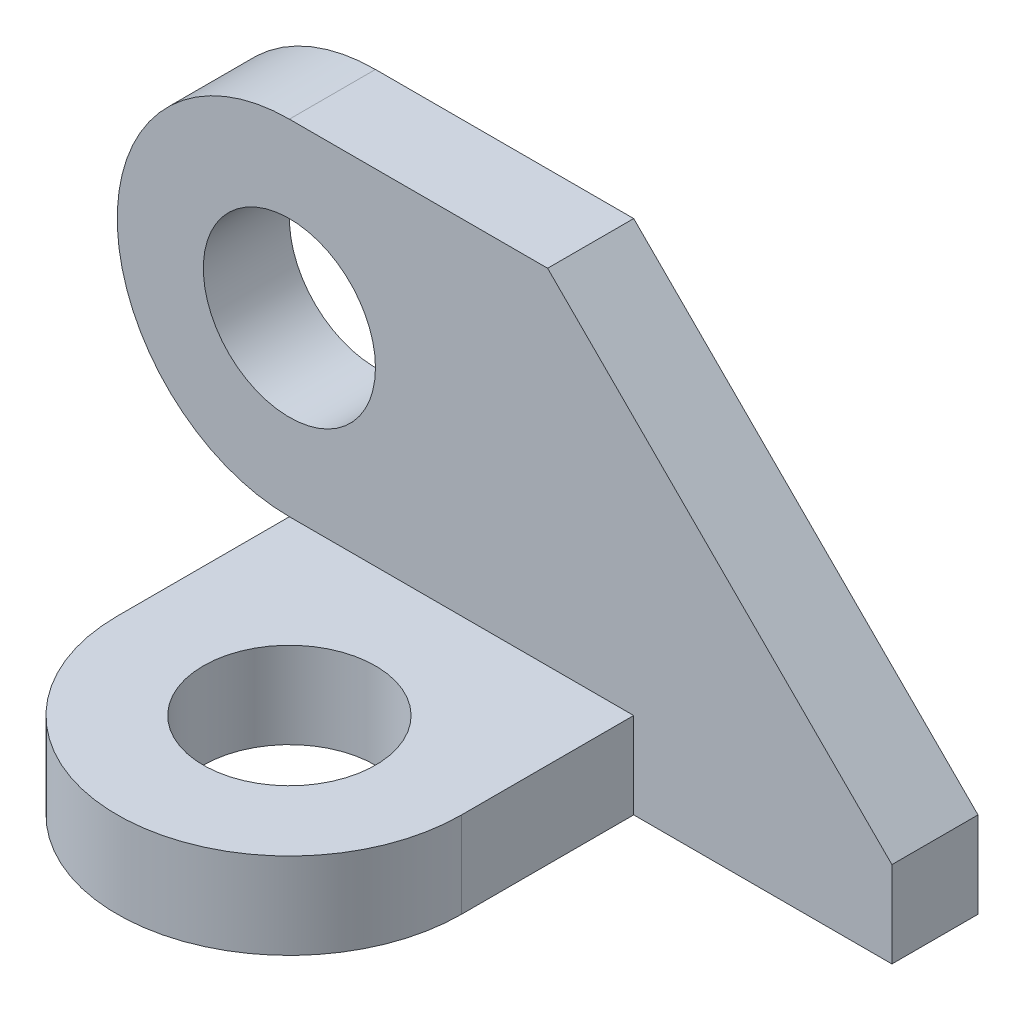
ISO-10303-21;
HEADER;
FILE_DESCRIPTION(('STEP AP214'),'2;1');
FILE_NAME('part.step','',(''),(''),'','','');
FILE_SCHEMA(('AUTOMOTIVE_DESIGN { 1 0 10303 214 1 1 1 1 }'));
ENDSEC;
DATA;
#1=APPLICATION_CONTEXT('core data for automotive mechanical design processes');
#2=APPLICATION_PROTOCOL_DEFINITION('international standard','automotive_design',2000,#1);
#3=PRODUCT_CONTEXT('',#1,'mechanical');
#4=PRODUCT('Part','Part','',(#3));
#5=PRODUCT_RELATED_PRODUCT_CATEGORY('part','',(#4));
#6=PRODUCT_DEFINITION_FORMATION('','',#4);
#7=PRODUCT_DEFINITION_CONTEXT('part definition',#1,'design');
#8=PRODUCT_DEFINITION('design','',#6,#7);
#9=PRODUCT_DEFINITION_SHAPE('','',#8);
#10=(LENGTH_UNIT() NAMED_UNIT(*) SI_UNIT(.MILLI.,.METRE.));
#11=(NAMED_UNIT(*) PLANE_ANGLE_UNIT() SI_UNIT($,.RADIAN.));
#12=(NAMED_UNIT(*) SI_UNIT($,.STERADIAN.) SOLID_ANGLE_UNIT());
#13=UNCERTAINTY_MEASURE_WITH_UNIT(LENGTH_MEASURE(1.E-05),#10,'distance_accuracy_value','');
#14=(GEOMETRIC_REPRESENTATION_CONTEXT(3) GLOBAL_UNCERTAINTY_ASSIGNED_CONTEXT((#13)) GLOBAL_UNIT_ASSIGNED_CONTEXT((#10,
#11,#12)) REPRESENTATION_CONTEXT('',''));
#15=CARTESIAN_POINT('',(0.,0.,0.));
#16=DIRECTION('',(0.,0.,1.));
#17=DIRECTION('',(1.,0.,0.));
#18=AXIS2_PLACEMENT_3D('',#15,#16,#17);
#19=CARTESIAN_POINT('',(0.,0.,5.));
#20=DIRECTION('',(0.,0.,1.));
#21=DIRECTION('',(1.,0.,0.));
#22=AXIS2_PLACEMENT_3D('',#19,#20,#21);
#23=PLANE('',#22);
#24=DIRECTION('',(-1.,0.,0.));
#25=VECTOR('',#24,1.);
#26=CARTESIAN_POINT('',(35.,-10.,5.));
#27=LINE('',#26,#25);
#28=CARTESIAN_POINT('',(20.,-10.,5.));
#29=VERTEX_POINT('',#28);
#30=CARTESIAN_POINT('',(0.,-10.,5.));
#31=VERTEX_POINT('',#30);
#32=EDGE_CURVE('E117',#29,#31,#27,.T.);
#33=ORIENTED_EDGE('',*,*,#32,.F.);
#34=DIRECTION('',(0.,-1.,0.));
#35=VECTOR('',#34,1.);
#36=CARTESIAN_POINT('',(20.,-10.,5.));
#37=LINE('',#36,#35);
#38=CARTESIAN_POINT('',(20.,-15.,5.));
#39=VERTEX_POINT('',#38);
#40=EDGE_CURVE('E114',#29,#39,#37,.T.);
#41=ORIENTED_EDGE('',*,*,#40,.T.);
#42=DIRECTION('',(1.,0.,0.));
#43=VECTOR('',#42,1.);
#44=CARTESIAN_POINT('',(35.,-15.,5.));
#45=LINE('',#44,#43);
#46=CARTESIAN_POINT('',(35.,-15.,5.));
#47=VERTEX_POINT('',#46);
#48=EDGE_CURVE('E90',#39,#47,#45,.T.);
#49=ORIENTED_EDGE('',*,*,#48,.T.);
#50=DIRECTION('',(0.,1.,0.));
#51=VECTOR('',#50,1.);
#52=CARTESIAN_POINT('',(35.,-10.,5.));
#53=LINE('',#52,#51);
#54=CARTESIAN_POINT('',(35.,-10.,5.));
#55=VERTEX_POINT('',#54);
#56=EDGE_CURVE('E147',#47,#55,#53,.T.);
#57=ORIENTED_EDGE('',*,*,#56,.T.);
#58=DIRECTION('',(-0.707106781186548,0.707106781186547,0.));
#59=VECTOR('',#58,1.);
#60=CARTESIAN_POINT('',(15.,10.,5.));
#61=LINE('',#60,#59);
#62=CARTESIAN_POINT('',(15.,10.,5.));
#63=VERTEX_POINT('',#62);
#64=EDGE_CURVE('E149',#55,#63,#61,.T.);
#65=ORIENTED_EDGE('',*,*,#64,.T.);
#66=DIRECTION('',(-1.,0.,0.));
#67=VECTOR('',#66,1.);
#68=CARTESIAN_POINT('',(0.,10.,5.));
#69=LINE('',#68,#67);
#70=CARTESIAN_POINT('',(0.,10.,5.));
#71=VERTEX_POINT('',#70);
#72=EDGE_CURVE('E57',#63,#71,#69,.T.);
#73=ORIENTED_EDGE('',*,*,#72,.T.);
#74=CARTESIAN_POINT('',(0.,0.,5.));
#75=DIRECTION('',(0.,0.,1.));
#76=DIRECTION('',(1.,0.,0.));
#77=AXIS2_PLACEMENT_3D('',#74,#75,#76);
#78=CIRCLE('',#77,10.);
#79=EDGE_CURVE('E144',#71,#31,#78,.T.);
#80=ORIENTED_EDGE('',*,*,#79,.T.);
#81=EDGE_LOOP('',(#33,#41,#49,#57,#65,#73,#80));
#82=FACE_BOUND('',#81,.T.);
#83=CARTESIAN_POINT('',(0.,0.,5.));
#84=DIRECTION('',(0.,0.,1.));
#85=DIRECTION('',(1.,0.,0.));
#86=AXIS2_PLACEMENT_3D('',#83,#84,#85);
#87=CIRCLE('',#86,5.);
#88=CARTESIAN_POINT('',(5.,0.,5.));
#89=VERTEX_POINT('',#88);
#90=EDGE_CURVE('E135',#89,#89,#87,.T.);
#91=ORIENTED_EDGE('',*,*,#90,.F.);
#92=EDGE_LOOP('',(#91));
#93=FACE_BOUND('',#92,.T.);
#94=ADVANCED_FACE('F33',(#82,#93),#23,.T.);
#95=CARTESIAN_POINT('',(0.,0.,0.));
#96=DIRECTION('',(0.,0.,1.));
#97=DIRECTION('',(1.,0.,0.));
#98=AXIS2_PLACEMENT_3D('',#95,#96,#97);
#99=PLANE('',#98);
#100=CARTESIAN_POINT('',(0.,0.,0.));
#101=DIRECTION('',(0.,0.,1.));
#102=DIRECTION('',(1.,0.,0.));
#103=AXIS2_PLACEMENT_3D('',#100,#101,#102);
#104=CIRCLE('',#103,10.);
#105=CARTESIAN_POINT('',(0.,10.,0.));
#106=VERTEX_POINT('',#105);
#107=CARTESIAN_POINT('',(0.,-10.,0.));
#108=VERTEX_POINT('',#107);
#109=EDGE_CURVE('E142',#106,#108,#104,.T.);
#110=ORIENTED_EDGE('',*,*,#109,.F.);
#111=DIRECTION('',(-1.,0.,0.));
#112=VECTOR('',#111,1.);
#113=CARTESIAN_POINT('',(0.,10.,0.));
#114=LINE('',#113,#112);
#115=CARTESIAN_POINT('',(15.,10.,0.));
#116=VERTEX_POINT('',#115);
#117=EDGE_CURVE('E84',#116,#106,#114,.T.);
#118=ORIENTED_EDGE('',*,*,#117,.F.);
#119=DIRECTION('',(-0.707106781186548,0.707106781186547,0.));
#120=VECTOR('',#119,1.);
#121=CARTESIAN_POINT('',(15.,10.,0.));
#122=LINE('',#121,#120);
#123=CARTESIAN_POINT('',(35.,-10.,0.));
#124=VERTEX_POINT('',#123);
#125=EDGE_CURVE('E161',#124,#116,#122,.T.);
#126=ORIENTED_EDGE('',*,*,#125,.F.);
#127=DIRECTION('',(0.,1.,0.));
#128=VECTOR('',#127,1.);
#129=CARTESIAN_POINT('',(35.,-10.,0.));
#130=LINE('',#129,#128);
#131=CARTESIAN_POINT('',(35.,-15.,0.));
#132=VERTEX_POINT('',#131);
#133=EDGE_CURVE('E159',#132,#124,#130,.T.);
#134=ORIENTED_EDGE('',*,*,#133,.F.);
#135=DIRECTION('',(1.,0.,0.));
#136=VECTOR('',#135,1.);
#137=CARTESIAN_POINT('',(35.,-15.,0.));
#138=LINE('',#137,#136);
#139=CARTESIAN_POINT('',(0.,-15.,0.));
#140=VERTEX_POINT('',#139);
#141=EDGE_CURVE('E157',#140,#132,#138,.T.);
#142=ORIENTED_EDGE('',*,*,#141,.F.);
#143=DIRECTION('',(0.,-1.,0.));
#144=VECTOR('',#143,1.);
#145=CARTESIAN_POINT('',(0.,-15.,0.));
#146=LINE('',#145,#144);
#147=EDGE_CURVE('E155',#108,#140,#146,.T.);
#148=ORIENTED_EDGE('',*,*,#147,.F.);
#149=EDGE_LOOP('',(#110,#118,#126,#134,#142,#148));
#150=FACE_BOUND('',#149,.T.);
#151=CARTESIAN_POINT('',(0.,0.,0.));
#152=DIRECTION('',(0.,0.,1.));
#153=DIRECTION('',(1.,0.,0.));
#154=AXIS2_PLACEMENT_3D('',#151,#152,#153);
#155=CIRCLE('',#154,5.);
#156=CARTESIAN_POINT('',(5.,0.,0.));
#157=VERTEX_POINT('',#156);
#158=EDGE_CURVE('E132',#157,#157,#155,.T.);
#159=ORIENTED_EDGE('',*,*,#158,.T.);
#160=EDGE_LOOP('',(#159));
#161=FACE_BOUND('',#160,.T.);
#162=ADVANCED_FACE('F181',(#150,#161),#99,.F.);
#163=CARTESIAN_POINT('',(0.,0.,5.));
#164=DIRECTION('',(0.,0.,-1.));
#165=DIRECTION('',(-1.,0.,0.));
#166=AXIS2_PLACEMENT_3D('',#163,#164,#165);
#167=CYLINDRICAL_SURFACE('',#166,10.);
#168=ORIENTED_EDGE('',*,*,#109,.T.);
#169=DIRECTION('',(0.,0.,-1.));
#170=VECTOR('',#169,1.);
#171=CARTESIAN_POINT('',(0.,-10.,5.));
#172=LINE('',#171,#170);
#173=EDGE_CURVE('E11',#31,#108,#172,.T.);
#174=ORIENTED_EDGE('',*,*,#173,.F.);
#175=ORIENTED_EDGE('',*,*,#79,.F.);
#176=DIRECTION('',(0.,0.,-1.));
#177=VECTOR('',#176,1.);
#178=CARTESIAN_POINT('',(0.,10.,5.));
#179=LINE('',#178,#177);
#180=EDGE_CURVE('E152',#71,#106,#179,.T.);
#181=ORIENTED_EDGE('',*,*,#180,.T.);
#182=EDGE_LOOP('',(#168,#174,#175,#181));
#183=FACE_BOUND('',#182,.T.);
#184=ADVANCED_FACE('F35',(#183),#167,.T.);
#185=CARTESIAN_POINT('',(0.,-15.,5.));
#186=DIRECTION('',(1.,0.,0.));
#187=DIRECTION('',(0.,0.,-1.));
#188=AXIS2_PLACEMENT_3D('',#185,#186,#187);
#189=PLANE('',#188);
#190=ORIENTED_EDGE('',*,*,#147,.T.);
#191=DIRECTION('',(0.,0.,-1.));
#192=VECTOR('',#191,1.);
#193=CARTESIAN_POINT('',(0.,-15.,5.));
#194=LINE('',#193,#192);
#195=CARTESIAN_POINT('',(0.,-15.,15.));
#196=VERTEX_POINT('',#195);
#197=EDGE_CURVE('E41',#196,#140,#194,.T.);
#198=ORIENTED_EDGE('',*,*,#197,.F.);
#199=DIRECTION('',(0.,-1.,0.));
#200=VECTOR('',#199,1.);
#201=CARTESIAN_POINT('',(0.,-10.,15.));
#202=LINE('',#201,#200);
#203=CARTESIAN_POINT('',(0.,-10.,15.));
#204=VERTEX_POINT('',#203);
#205=EDGE_CURVE('E137',#204,#196,#202,.T.);
#206=ORIENTED_EDGE('',*,*,#205,.F.);
#207=DIRECTION('',(0.,0.,1.));
#208=VECTOR('',#207,1.);
#209=CARTESIAN_POINT('',(0.,-10.,5.00000000000001));
#210=LINE('',#209,#208);
#211=EDGE_CURVE('E124',#31,#204,#210,.T.);
#212=ORIENTED_EDGE('',*,*,#211,.F.);
#213=ORIENTED_EDGE('',*,*,#173,.T.);
#214=EDGE_LOOP('',(#190,#198,#206,#212,#213));
#215=FACE_BOUND('',#214,.T.);
#216=ADVANCED_FACE('F208',(#215),#189,.F.);
#217=CARTESIAN_POINT('',(35.,-15.,5.));
#218=DIRECTION('',(0.,1.,0.));
#219=DIRECTION('',(-1.,0.,0.));
#220=AXIS2_PLACEMENT_3D('',#217,#218,#219);
#221=PLANE('',#220);
#222=ORIENTED_EDGE('',*,*,#141,.T.);
#223=DIRECTION('',(0.,0.,-1.));
#224=VECTOR('',#223,1.);
#225=CARTESIAN_POINT('',(35.,-15.,5.));
#226=LINE('',#225,#224);
#227=EDGE_CURVE('E170',#47,#132,#226,.T.);
#228=ORIENTED_EDGE('',*,*,#227,.F.);
#229=ORIENTED_EDGE('',*,*,#48,.F.);
#230=DIRECTION('',(0.,0.,-1.));
#231=VECTOR('',#230,1.);
#232=CARTESIAN_POINT('',(20.,-15.,5.));
#233=LINE('',#232,#231);
#234=CARTESIAN_POINT('',(20.,-15.,15.));
#235=VERTEX_POINT('',#234);
#236=EDGE_CURVE('E48',#235,#39,#233,.T.);
#237=ORIENTED_EDGE('',*,*,#236,.F.);
#238=CARTESIAN_POINT('',(10.,-15.,15.));
#239=DIRECTION('',(0.,1.,0.));
#240=DIRECTION('',(-1.,0.,0.));
#241=AXIS2_PLACEMENT_3D('',#238,#239,#240);
#242=CIRCLE('',#241,10.);
#243=EDGE_CURVE('E131',#196,#235,#242,.T.);
#244=ORIENTED_EDGE('',*,*,#243,.F.);
#245=ORIENTED_EDGE('',*,*,#197,.T.);
#246=EDGE_LOOP('',(#222,#228,#229,#237,#244,#245));
#247=FACE_BOUND('',#246,.T.);
#248=CARTESIAN_POINT('',(10.,-15.,15.));
#249=DIRECTION('',(0.,1.,0.));
#250=DIRECTION('',(-1.,0.,0.));
#251=AXIS2_PLACEMENT_3D('',#248,#249,#250);
#252=CIRCLE('',#251,5.);
#253=CARTESIAN_POINT('',(5.,-15.,15.));
#254=VERTEX_POINT('',#253);
#255=EDGE_CURVE('E229',#254,#254,#252,.T.);
#256=ORIENTED_EDGE('',*,*,#255,.T.);
#257=EDGE_LOOP('',(#256));
#258=FACE_BOUND('',#257,.T.);
#259=ADVANCED_FACE('F175',(#247,#258),#221,.F.);
#260=CARTESIAN_POINT('',(35.,-10.,5.));
#261=DIRECTION('',(-1.,0.,0.));
#262=DIRECTION('',(0.,0.,1.));
#263=AXIS2_PLACEMENT_3D('',#260,#261,#262);
#264=PLANE('',#263);
#265=ORIENTED_EDGE('',*,*,#133,.T.);
#266=DIRECTION('',(0.,0.,-1.));
#267=VECTOR('',#266,1.);
#268=CARTESIAN_POINT('',(35.,-10.,5.));
#269=LINE('',#268,#267);
#270=EDGE_CURVE('E167',#55,#124,#269,.T.);
#271=ORIENTED_EDGE('',*,*,#270,.F.);
#272=ORIENTED_EDGE('',*,*,#56,.F.);
#273=ORIENTED_EDGE('',*,*,#227,.T.);
#274=EDGE_LOOP('',(#265,#271,#272,#273));
#275=FACE_BOUND('',#274,.T.);
#276=ADVANCED_FACE('F186',(#275),#264,.F.);
#277=CARTESIAN_POINT('',(15.,10.,5.));
#278=DIRECTION('',(-0.707106781186547,-0.707106781186548,0.));
#279=DIRECTION('',(0.707106781186548,-0.707106781186547,0.));
#280=AXIS2_PLACEMENT_3D('',#277,#278,#279);
#281=PLANE('',#280);
#282=ORIENTED_EDGE('',*,*,#125,.T.);
#283=DIRECTION('',(0.,0.,-1.));
#284=VECTOR('',#283,1.);
#285=CARTESIAN_POINT('',(15.,10.,5.));
#286=LINE('',#285,#284);
#287=EDGE_CURVE('E165',#63,#116,#286,.T.);
#288=ORIENTED_EDGE('',*,*,#287,.F.);
#289=ORIENTED_EDGE('',*,*,#64,.F.);
#290=ORIENTED_EDGE('',*,*,#270,.T.);
#291=EDGE_LOOP('',(#282,#288,#289,#290));
#292=FACE_BOUND('',#291,.T.);
#293=ADVANCED_FACE('F190',(#292),#281,.F.);
#294=CARTESIAN_POINT('',(0.,10.,5.));
#295=DIRECTION('',(0.,-1.,0.));
#296=DIRECTION('',(1.,0.,0.));
#297=AXIS2_PLACEMENT_3D('',#294,#295,#296);
#298=PLANE('',#297);
#299=ORIENTED_EDGE('',*,*,#117,.T.);
#300=ORIENTED_EDGE('',*,*,#180,.F.);
#301=ORIENTED_EDGE('',*,*,#72,.F.);
#302=ORIENTED_EDGE('',*,*,#287,.T.);
#303=EDGE_LOOP('',(#299,#300,#301,#302));
#304=FACE_BOUND('',#303,.T.);
#305=ADVANCED_FACE('F200',(#304),#298,.F.);
#306=CARTESIAN_POINT('',(0.,0.,5.));
#307=DIRECTION('',(0.,0.,-1.));
#308=DIRECTION('',(-1.,0.,0.));
#309=AXIS2_PLACEMENT_3D('',#306,#307,#308);
#310=CYLINDRICAL_SURFACE('',#309,5.);
#311=ORIENTED_EDGE('',*,*,#90,.T.);
#312=EDGE_LOOP('',(#311));
#313=FACE_BOUND('',#312,.T.);
#314=ORIENTED_EDGE('',*,*,#158,.F.);
#315=EDGE_LOOP('',(#314));
#316=FACE_BOUND('',#315,.T.);
#317=ADVANCED_FACE('F197',(#313,#316),#310,.F.);
#318=CARTESIAN_POINT('',(10.,-10.,15.));
#319=DIRECTION('',(0.,1.,0.));
#320=DIRECTION('',(-1.,0.,0.));
#321=AXIS2_PLACEMENT_3D('',#318,#319,#320);
#322=PLANE('',#321);
#323=CARTESIAN_POINT('',(10.,-10.,15.));
#324=DIRECTION('',(0.,1.,0.));
#325=DIRECTION('',(-1.,0.,0.));
#326=AXIS2_PLACEMENT_3D('',#323,#324,#325);
#327=CIRCLE('',#326,10.);
#328=CARTESIAN_POINT('',(20.,-10.,15.));
#329=VERTEX_POINT('',#328);
#330=EDGE_CURVE('E118',#204,#329,#327,.T.);
#331=ORIENTED_EDGE('',*,*,#330,.T.);
#332=DIRECTION('',(0.,0.,-1.));
#333=VECTOR('',#332,1.);
#334=CARTESIAN_POINT('',(20.,-10.,5.));
#335=LINE('',#334,#333);
#336=EDGE_CURVE('E108',#329,#29,#335,.T.);
#337=ORIENTED_EDGE('',*,*,#336,.T.);
#338=ORIENTED_EDGE('',*,*,#32,.T.);
#339=ORIENTED_EDGE('',*,*,#211,.T.);
#340=EDGE_LOOP('',(#331,#337,#338,#339));
#341=FACE_BOUND('',#340,.T.);
#342=CARTESIAN_POINT('',(10.,-10.,15.));
#343=DIRECTION('',(0.,1.,0.));
#344=DIRECTION('',(-1.,0.,0.));
#345=AXIS2_PLACEMENT_3D('',#342,#343,#344);
#346=CIRCLE('',#345,5.);
#347=CARTESIAN_POINT('',(5.,-10.,15.));
#348=VERTEX_POINT('',#347);
#349=EDGE_CURVE('E227',#348,#348,#346,.T.);
#350=ORIENTED_EDGE('',*,*,#349,.F.);
#351=EDGE_LOOP('',(#350));
#352=FACE_BOUND('',#351,.T.);
#353=ADVANCED_FACE('F121',(#341,#352),#322,.T.);
#354=CARTESIAN_POINT('',(10.,-10.,15.));
#355=DIRECTION('',(0.,-1.,0.));
#356=DIRECTION('',(0.,0.,-1.));
#357=AXIS2_PLACEMENT_3D('',#354,#355,#356);
#358=CYLINDRICAL_SURFACE('',#357,10.);
#359=ORIENTED_EDGE('',*,*,#243,.T.);
#360=DIRECTION('',(0.,-1.,0.));
#361=VECTOR('',#360,1.);
#362=CARTESIAN_POINT('',(20.,-10.,15.));
#363=LINE('',#362,#361);
#364=EDGE_CURVE('E112',#329,#235,#363,.T.);
#365=ORIENTED_EDGE('',*,*,#364,.F.);
#366=ORIENTED_EDGE('',*,*,#330,.F.);
#367=ORIENTED_EDGE('',*,*,#205,.T.);
#368=EDGE_LOOP('',(#359,#365,#366,#367));
#369=FACE_BOUND('',#368,.T.);
#370=ADVANCED_FACE('F129',(#369),#358,.T.);
#371=CARTESIAN_POINT('',(20.,-10.,5.));
#372=DIRECTION('',(-1.,0.,0.));
#373=DIRECTION('',(0.,0.,1.));
#374=AXIS2_PLACEMENT_3D('',#371,#372,#373);
#375=PLANE('',#374);
#376=ORIENTED_EDGE('',*,*,#236,.T.);
#377=ORIENTED_EDGE('',*,*,#40,.F.);
#378=ORIENTED_EDGE('',*,*,#336,.F.);
#379=ORIENTED_EDGE('',*,*,#364,.T.);
#380=EDGE_LOOP('',(#376,#377,#378,#379));
#381=FACE_BOUND('',#380,.T.);
#382=ADVANCED_FACE('F110',(#381),#375,.F.);
#383=CARTESIAN_POINT('',(10.,-10.,15.));
#384=DIRECTION('',(0.,-1.,0.));
#385=DIRECTION('',(0.,0.,-1.));
#386=AXIS2_PLACEMENT_3D('',#383,#384,#385);
#387=CYLINDRICAL_SURFACE('',#386,5.);
#388=ORIENTED_EDGE('',*,*,#349,.T.);
#389=EDGE_LOOP('',(#388));
#390=FACE_BOUND('',#389,.T.);
#391=ORIENTED_EDGE('',*,*,#255,.F.);
#392=EDGE_LOOP('',(#391));
#393=FACE_BOUND('',#392,.T.);
#394=ADVANCED_FACE('F237',(#390,#393),#387,.F.);
#395=CLOSED_SHELL('',(#94,#162,#184,#216,#259,#276,#293,#305,#317,#353,#370,#382,#394));
#396=MANIFOLD_SOLID_BREP('B2',#395);
#397=ADVANCED_BREP_SHAPE_REPRESENTATION('',(#18,#396),#14);
#398=SHAPE_DEFINITION_REPRESENTATION(#9,#397);
ENDSEC;
END-ISO-10303-21;
